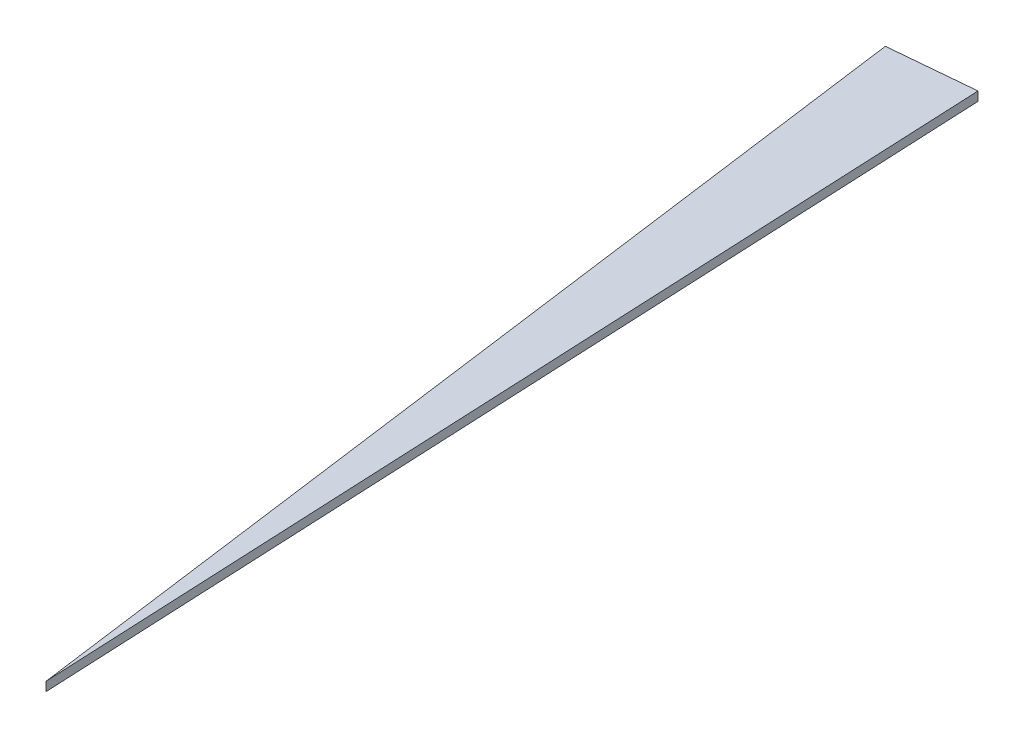
ISO-10303-21;
HEADER;
FILE_DESCRIPTION(('STEP AP214'),'2;1');
FILE_NAME('part.step','',(''),(''),'','','');
FILE_SCHEMA(('AUTOMOTIVE_DESIGN { 1 0 10303 214 1 1 1 1 }'));
ENDSEC;
DATA;
#1=APPLICATION_CONTEXT('core data for automotive mechanical design processes');
#2=APPLICATION_PROTOCOL_DEFINITION('international standard','automotive_design',2000,#1);
#3=PRODUCT_CONTEXT('',#1,'mechanical');
#4=PRODUCT('Part','Part','',(#3));
#5=PRODUCT_RELATED_PRODUCT_CATEGORY('part','',(#4));
#6=PRODUCT_DEFINITION_FORMATION('','',#4);
#7=PRODUCT_DEFINITION_CONTEXT('part definition',#1,'design');
#8=PRODUCT_DEFINITION('design','',#6,#7);
#9=PRODUCT_DEFINITION_SHAPE('','',#8);
#10=(LENGTH_UNIT() NAMED_UNIT(*) SI_UNIT(.MILLI.,.METRE.));
#11=(NAMED_UNIT(*) PLANE_ANGLE_UNIT() SI_UNIT($,.RADIAN.));
#12=(NAMED_UNIT(*) SI_UNIT($,.STERADIAN.) SOLID_ANGLE_UNIT());
#13=UNCERTAINTY_MEASURE_WITH_UNIT(LENGTH_MEASURE(1.E-05),#10,'distance_accuracy_value','');
#14=(GEOMETRIC_REPRESENTATION_CONTEXT(3) GLOBAL_UNCERTAINTY_ASSIGNED_CONTEXT((#13)) GLOBAL_UNIT_ASSIGNED_CONTEXT((#10,
#11,#12)) REPRESENTATION_CONTEXT('',''));
#15=CARTESIAN_POINT('',(0.,0.,0.));
#16=DIRECTION('',(0.,0.,1.));
#17=DIRECTION('',(1.,0.,0.));
#18=AXIS2_PLACEMENT_3D('',#15,#16,#17);
#19=CARTESIAN_POINT('',(0.,0.6,0.));
#20=DIRECTION('',(-0.998930077389047,0.,0.0462460861858926));
#21=DIRECTION('',(0.0462460861858926,0.,0.998930077389047));
#22=AXIS2_PLACEMENT_3D('',#19,#20,#21);
#23=PLANE('',#22);
#24=DIRECTION('',(-0.0462460861858926,0.,-0.998930077389047));
#25=VECTOR('',#24,1.);
#26=CARTESIAN_POINT('',(0.,0.,0.));
#27=LINE('',#26,#25);
#28=CARTESIAN_POINT('',(0.,0.,0.));
#29=VERTEX_POINT('',#28);
#30=CARTESIAN_POINT('',(-3.00599560208302,0.,-64.930455030288));
#31=VERTEX_POINT('',#30);
#32=EDGE_CURVE('E86',#29,#31,#27,.T.);
#33=ORIENTED_EDGE('',*,*,#32,.T.);
#34=DIRECTION('',(0.,-1.,0.));
#35=VECTOR('',#34,1.);
#36=CARTESIAN_POINT('',(-3.00599560208302,0.6,-64.930455030288));
#37=LINE('',#36,#35);
#38=CARTESIAN_POINT('',(-3.00599560208302,0.6,-64.930455030288));
#39=VERTEX_POINT('',#38);
#40=EDGE_CURVE('E11',#39,#31,#37,.T.);
#41=ORIENTED_EDGE('',*,*,#40,.F.);
#42=DIRECTION('',(-0.0462460861858926,0.,-0.998930077389047));
#43=VECTOR('',#42,1.);
#44=CARTESIAN_POINT('',(0.,0.6,0.));
#45=LINE('',#44,#43);
#46=CARTESIAN_POINT('',(0.,0.6,0.));
#47=VERTEX_POINT('',#46);
#48=EDGE_CURVE('E79',#47,#39,#45,.T.);
#49=ORIENTED_EDGE('',*,*,#48,.F.);
#50=DIRECTION('',(0.,-1.,0.));
#51=VECTOR('',#50,1.);
#52=CARTESIAN_POINT('',(0.,0.6,0.));
#53=LINE('',#52,#51);
#54=EDGE_CURVE('E87',#47,#29,#53,.T.);
#55=ORIENTED_EDGE('',*,*,#54,.T.);
#56=EDGE_LOOP('',(#33,#41,#49,#55));
#57=FACE_BOUND('',#56,.T.);
#58=ADVANCED_FACE('F39',(#57),#23,.F.);
#59=CARTESIAN_POINT('',(-8.65361891639039,0.6,-64.4213852664617));
#60=DIRECTION('',(0.0897747881556545,0.,0.995962091352682));
#61=DIRECTION('',(0.995962091352682,0.,-0.0897747881556545));
#62=AXIS2_PLACEMENT_3D('',#59,#60,#61);
#63=PLANE('',#62);
#64=DIRECTION('',(-0.995962091352682,0.,0.0897747881556545));
#65=VECTOR('',#64,1.);
#66=CARTESIAN_POINT('',(-8.65361891639039,0.,-64.4213852664617));
#67=LINE('',#66,#65);
#68=CARTESIAN_POINT('',(-8.65361891639039,0.,-64.4213852664617));
#69=VERTEX_POINT('',#68);
#70=EDGE_CURVE('E67',#31,#69,#67,.T.);
#71=ORIENTED_EDGE('',*,*,#70,.T.);
#72=DIRECTION('',(0.,-1.,0.));
#73=VECTOR('',#72,1.);
#74=CARTESIAN_POINT('',(-8.65361891639039,0.6,-64.4213852664617));
#75=LINE('',#74,#73);
#76=CARTESIAN_POINT('',(-8.65361891639039,0.6,-64.4213852664617));
#77=VERTEX_POINT('',#76);
#78=EDGE_CURVE('E47',#77,#69,#75,.T.);
#79=ORIENTED_EDGE('',*,*,#78,.F.);
#80=DIRECTION('',(-0.995962091352682,0.,0.0897747881556545));
#81=VECTOR('',#80,1.);
#82=CARTESIAN_POINT('',(-8.65361891639039,0.6,-64.4213852664617));
#83=LINE('',#82,#81);
#84=EDGE_CURVE('E75',#39,#77,#83,.T.);
#85=ORIENTED_EDGE('',*,*,#84,.F.);
#86=ORIENTED_EDGE('',*,*,#40,.T.);
#87=EDGE_LOOP('',(#71,#79,#85,#86));
#88=FACE_BOUND('',#87,.T.);
#89=ADVANCED_FACE('F76',(#88),#63,.F.);
#90=CARTESIAN_POINT('',(0.,0.6,0.));
#91=DIRECTION('',(0.991098234868642,0.,-0.133132598713698));
#92=DIRECTION('',(-0.133132598713698,0.,-0.991098234868642));
#93=AXIS2_PLACEMENT_3D('',#90,#91,#92);
#94=PLANE('',#93);
#95=DIRECTION('',(0.133132598713698,0.,0.991098234868642));
#96=VECTOR('',#95,1.);
#97=CARTESIAN_POINT('',(0.,0.,0.));
#98=LINE('',#97,#96);
#99=EDGE_CURVE('E72',#69,#29,#98,.T.);
#100=ORIENTED_EDGE('',*,*,#99,.T.);
#101=ORIENTED_EDGE('',*,*,#54,.F.);
#102=DIRECTION('',(0.133132598713698,0.,0.991098234868642));
#103=VECTOR('',#102,1.);
#104=CARTESIAN_POINT('',(0.,0.6,0.));
#105=LINE('',#104,#103);
#106=EDGE_CURVE('E55',#77,#47,#105,.T.);
#107=ORIENTED_EDGE('',*,*,#106,.F.);
#108=ORIENTED_EDGE('',*,*,#78,.T.);
#109=EDGE_LOOP('',(#100,#101,#107,#108));
#110=FACE_BOUND('',#109,.T.);
#111=ADVANCED_FACE('F94',(#110),#94,.F.);
#112=CARTESIAN_POINT('',(0.,0.6,0.));
#113=DIRECTION('',(0.,-1.,0.));
#114=DIRECTION('',(0.,0.,-1.));
#115=AXIS2_PLACEMENT_3D('',#112,#113,#114);
#116=PLANE('',#115);
#117=ORIENTED_EDGE('',*,*,#48,.T.);
#118=ORIENTED_EDGE('',*,*,#84,.T.);
#119=ORIENTED_EDGE('',*,*,#106,.T.);
#120=EDGE_LOOP('',(#117,#118,#119));
#121=FACE_BOUND('',#120,.T.);
#122=ADVANCED_FACE('F82',(#121),#116,.F.);
#123=CARTESIAN_POINT('',(0.,0.,0.));
#124=DIRECTION('',(0.,-1.,0.));
#125=DIRECTION('',(0.,0.,-1.));
#126=AXIS2_PLACEMENT_3D('',#123,#124,#125);
#127=PLANE('',#126);
#128=ORIENTED_EDGE('',*,*,#32,.F.);
#129=ORIENTED_EDGE('',*,*,#99,.F.);
#130=ORIENTED_EDGE('',*,*,#70,.F.);
#131=EDGE_LOOP('',(#128,#129,#130));
#132=FACE_BOUND('',#131,.T.);
#133=ADVANCED_FACE('F95',(#132),#127,.T.);
#134=CLOSED_SHELL('',(#58,#89,#111,#122,#133));
#135=MANIFOLD_SOLID_BREP('B2',#134);
#136=ADVANCED_BREP_SHAPE_REPRESENTATION('',(#18,#135),#14);
#137=SHAPE_DEFINITION_REPRESENTATION(#9,#136);
ENDSEC;
END-ISO-10303-21;
